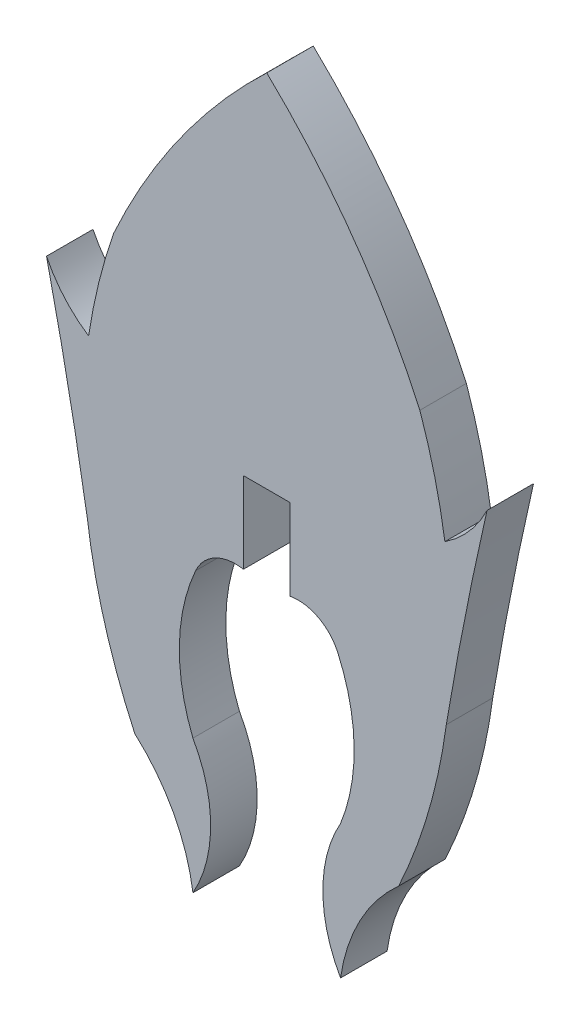
ISO-10303-21;
HEADER;
FILE_DESCRIPTION(('STEP AP214'),'2;1');
FILE_NAME('part.step','',(''),(''),'','','');
FILE_SCHEMA(('AUTOMOTIVE_DESIGN { 1 0 10303 214 1 1 1 1 }'));
ENDSEC;
DATA;
#1=APPLICATION_CONTEXT('core data for automotive mechanical design processes');
#2=APPLICATION_PROTOCOL_DEFINITION('international standard','automotive_design',2000,#1);
#3=PRODUCT_CONTEXT('',#1,'mechanical');
#4=PRODUCT('Part','Part','',(#3));
#5=PRODUCT_RELATED_PRODUCT_CATEGORY('part','',(#4));
#6=PRODUCT_DEFINITION_FORMATION('','',#4);
#7=PRODUCT_DEFINITION_CONTEXT('part definition',#1,'design');
#8=PRODUCT_DEFINITION('design','',#6,#7);
#9=PRODUCT_DEFINITION_SHAPE('','',#8);
#10=(LENGTH_UNIT() NAMED_UNIT(*) SI_UNIT(.MILLI.,.METRE.));
#11=(NAMED_UNIT(*) PLANE_ANGLE_UNIT() SI_UNIT($,.RADIAN.));
#12=(NAMED_UNIT(*) SI_UNIT($,.STERADIAN.) SOLID_ANGLE_UNIT());
#13=UNCERTAINTY_MEASURE_WITH_UNIT(LENGTH_MEASURE(1.E-05),#10,'distance_accuracy_value','');
#14=(GEOMETRIC_REPRESENTATION_CONTEXT(3) GLOBAL_UNCERTAINTY_ASSIGNED_CONTEXT((#13)) GLOBAL_UNIT_ASSIGNED_CONTEXT((#10,
#11,#12)) REPRESENTATION_CONTEXT('',''));
#15=CARTESIAN_POINT('',(0.,0.,0.));
#16=DIRECTION('',(0.,0.,1.));
#17=DIRECTION('',(1.,0.,0.));
#18=AXIS2_PLACEMENT_3D('',#15,#16,#17);
#19=CARTESIAN_POINT('',(-6.27252362891482,-9.76508493990558,1.524));
#20=DIRECTION('',(0.,0.,-1.));
#21=DIRECTION('',(-1.,0.,0.));
#22=AXIS2_PLACEMENT_3D('',#19,#20,#21);
#23=CYLINDRICAL_SURFACE('',#22,4.43516956083707);
#24=CARTESIAN_POINT('',(-6.27252362891482,-9.76508493990558,0.));
#25=DIRECTION('',(0.,0.,1.));
#26=DIRECTION('',(1.,0.,0.));
#27=AXIS2_PLACEMENT_3D('',#24,#25,#26);
#28=CIRCLE('',#27,4.43516956083707);
#29=CARTESIAN_POINT('',(-2.41824414537531,-7.57071516793412,0.));
#30=VERTEX_POINT('',#29);
#31=CARTESIAN_POINT('',(-2.41793526862089,-11.9589120994745,0.));
#32=VERTEX_POINT('',#31);
#33=EDGE_CURVE('E206',#30,#32,#28,.F.);
#34=ORIENTED_EDGE('',*,*,#33,.F.);
#35=DIRECTION('',(0.,0.,-1.));
#36=VECTOR('',#35,1.);
#37=CARTESIAN_POINT('',(-2.41824414537531,-7.57071516793412,1.524));
#38=LINE('',#37,#36);
#39=CARTESIAN_POINT('',(-2.41824414537531,-7.57071516793412,1.524));
#40=VERTEX_POINT('',#39);
#41=EDGE_CURVE('E11',#40,#30,#38,.T.);
#42=ORIENTED_EDGE('',*,*,#41,.F.);
#43=CARTESIAN_POINT('',(-6.27252362891482,-9.76508493990558,1.524));
#44=DIRECTION('',(0.,0.,1.));
#45=DIRECTION('',(1.,0.,0.));
#46=AXIS2_PLACEMENT_3D('',#43,#44,#45);
#47=CIRCLE('',#46,4.43516956083707);
#48=CARTESIAN_POINT('',(-2.41793526862089,-11.9589120994745,1.524));
#49=VERTEX_POINT('',#48);
#50=EDGE_CURVE('E258',#40,#49,#47,.F.);
#51=ORIENTED_EDGE('',*,*,#50,.T.);
#52=DIRECTION('',(0.,0.,-1.));
#53=VECTOR('',#52,1.);
#54=CARTESIAN_POINT('',(-2.41793526862089,-11.9589120994745,1.524));
#55=LINE('',#54,#53);
#56=EDGE_CURVE('E50',#49,#32,#55,.T.);
#57=ORIENTED_EDGE('',*,*,#56,.T.);
#58=EDGE_LOOP('',(#34,#42,#51,#57));
#59=FACE_BOUND('',#58,.T.);
#60=ADVANCED_FACE('F34',(#59),#23,.T.);
#61=CARTESIAN_POINT('',(3.26636391514258,-5.2767913050446,1.524));
#62=DIRECTION('',(0.,0.,-1.));
#63=DIRECTION('',(-1.,0.,0.));
#64=AXIS2_PLACEMENT_3D('',#61,#62,#63);
#65=CYLINDRICAL_SURFACE('',#64,6.12999636952902);
#66=CARTESIAN_POINT('',(3.26636391514258,-5.2767913050446,0.));
#67=DIRECTION('',(0.,0.,1.));
#68=DIRECTION('',(1.,0.,0.));
#69=AXIS2_PLACEMENT_3D('',#66,#67,#68);
#70=CIRCLE('',#69,6.12999636952902);
#71=CARTESIAN_POINT('',(-2.32866854028409,-2.77230187341165,0.));
#72=VERTEX_POINT('',#71);
#73=EDGE_CURVE('E208',#30,#72,#70,.F.);
#74=ORIENTED_EDGE('',*,*,#73,.T.);
#75=DIRECTION('',(0.,0.,-1.));
#76=VECTOR('',#75,1.);
#77=CARTESIAN_POINT('',(-2.32866854028409,-2.77230187341165,1.524));
#78=LINE('',#77,#76);
#79=CARTESIAN_POINT('',(-2.32866854028409,-2.77230187341165,1.524));
#80=VERTEX_POINT('',#79);
#81=EDGE_CURVE('E42',#80,#72,#78,.T.);
#82=ORIENTED_EDGE('',*,*,#81,.F.);
#83=CARTESIAN_POINT('',(3.26636391514258,-5.2767913050446,1.524));
#84=DIRECTION('',(0.,0.,1.));
#85=DIRECTION('',(1.,0.,0.));
#86=AXIS2_PLACEMENT_3D('',#83,#84,#85);
#87=CIRCLE('',#86,6.12999636952902);
#88=EDGE_CURVE('E322',#40,#80,#87,.F.);
#89=ORIENTED_EDGE('',*,*,#88,.F.);
#90=ORIENTED_EDGE('',*,*,#41,.T.);
#91=EDGE_LOOP('',(#74,#82,#89,#90));
#92=FACE_BOUND('',#91,.T.);
#93=ADVANCED_FACE('F368',(#92),#65,.F.);
#94=CARTESIAN_POINT('',(-1.02583500972069,-3.35442105462064,1.524));
#95=DIRECTION('',(0.,0.,-1.));
#96=DIRECTION('',(-1.,0.,0.));
#97=AXIS2_PLACEMENT_3D('',#94,#95,#96);
#98=CYLINDRICAL_SURFACE('',#97,1.42696809687243);
#99=CARTESIAN_POINT('',(-1.02583500972069,-3.35442105462064,0.));
#100=DIRECTION('',(0.,0.,1.));
#101=DIRECTION('',(1.,0.,0.));
#102=AXIS2_PLACEMENT_3D('',#99,#100,#101);
#103=CIRCLE('',#102,1.42696809687243);
#104=CARTESIAN_POINT('',(-0.763422706611532,-1.95178862498389,0.));
#105=VERTEX_POINT('',#104);
#106=EDGE_CURVE('E210',#72,#105,#103,.F.);
#107=ORIENTED_EDGE('',*,*,#106,.T.);
#108=DIRECTION('',(0.,0.,-1.));
#109=VECTOR('',#108,1.);
#110=CARTESIAN_POINT('',(-0.763422706611532,-1.95178862498389,1.524));
#111=LINE('',#110,#109);
#112=CARTESIAN_POINT('',(-0.763422706611532,-1.95178862498389,1.524));
#113=VERTEX_POINT('',#112);
#114=EDGE_CURVE('E296',#113,#105,#111,.T.);
#115=ORIENTED_EDGE('',*,*,#114,.F.);
#116=CARTESIAN_POINT('',(-1.02583500972069,-3.35442105462064,1.524));
#117=DIRECTION('',(0.,0.,1.));
#118=DIRECTION('',(1.,0.,0.));
#119=AXIS2_PLACEMENT_3D('',#116,#117,#118);
#120=CIRCLE('',#119,1.42696809687243);
#121=EDGE_CURVE('E304',#80,#113,#120,.F.);
#122=ORIENTED_EDGE('',*,*,#121,.F.);
#123=ORIENTED_EDGE('',*,*,#81,.T.);
#124=EDGE_LOOP('',(#107,#115,#122,#123));
#125=FACE_BOUND('',#124,.T.);
#126=ADVANCED_FACE('F302',(#125),#98,.F.);
#127=CARTESIAN_POINT('',(-0.761782717976915,0.000639877464380135,1.524));
#128=DIRECTION('',(0.999999647222261,-0.000839973424895943,0.));
#129=DIRECTION('',(0.000839973424895943,0.999999647222261,0.));
#130=AXIS2_PLACEMENT_3D('',#127,#128,#129);
#131=PLANE('',#130);
#132=DIRECTION('',(-0.000839973424895943,-0.999999647222261,0.));
#133=VECTOR('',#132,1.);
#134=CARTESIAN_POINT('',(-0.761782717976915,0.000639877464380135,0.));
#135=LINE('',#134,#133);
#136=CARTESIAN_POINT('',(-0.761189298872533,0.707113293703959,0.));
#137=VERTEX_POINT('',#136);
#138=EDGE_CURVE('E213',#137,#105,#135,.T.);
#139=ORIENTED_EDGE('',*,*,#138,.F.);
#140=DIRECTION('',(0.,0.,-1.));
#141=VECTOR('',#140,1.);
#142=CARTESIAN_POINT('',(-0.761189298872533,0.707113293703959,1.524));
#143=LINE('',#142,#141);
#144=CARTESIAN_POINT('',(-0.761189298872533,0.707113293703959,1.524));
#145=VERTEX_POINT('',#144);
#146=EDGE_CURVE('E294',#145,#137,#143,.T.);
#147=ORIENTED_EDGE('',*,*,#146,.F.);
#148=DIRECTION('',(-0.000839973424895943,-0.999999647222261,0.));
#149=VECTOR('',#148,1.);
#150=CARTESIAN_POINT('',(-0.761782717976915,0.000639877464380135,1.524));
#151=LINE('',#150,#149);
#152=EDGE_CURVE('E315',#145,#113,#151,.T.);
#153=ORIENTED_EDGE('',*,*,#152,.T.);
#154=ORIENTED_EDGE('',*,*,#114,.T.);
#155=EDGE_LOOP('',(#139,#147,#153,#154));
#156=FACE_BOUND('',#155,.T.);
#157=ADVANCED_FACE('F312',(#156),#131,.T.);
#158=CARTESIAN_POINT('',(0.,0.707113293703959,1.524));
#159=DIRECTION('',(0.,-1.,0.));
#160=DIRECTION('',(0.,0.,-1.));
#161=AXIS2_PLACEMENT_3D('',#158,#159,#160);
#162=PLANE('',#161);
#163=DIRECTION('',(-1.,0.,0.));
#164=VECTOR('',#163,1.);
#165=CARTESIAN_POINT('',(0.,0.707113293703959,0.));
#166=LINE('',#165,#164);
#167=CARTESIAN_POINT('',(0.762804564945485,0.707113293703959,0.));
#168=VERTEX_POINT('',#167);
#169=EDGE_CURVE('E216',#168,#137,#166,.T.);
#170=ORIENTED_EDGE('',*,*,#169,.F.);
#171=DIRECTION('',(0.,0.,-1.));
#172=VECTOR('',#171,1.);
#173=CARTESIAN_POINT('',(0.762804564945485,0.707113293703959,1.524));
#174=LINE('',#173,#172);
#175=CARTESIAN_POINT('',(0.762804564945485,0.707113293703959,1.524));
#176=VERTEX_POINT('',#175);
#177=EDGE_CURVE('E292',#176,#168,#174,.T.);
#178=ORIENTED_EDGE('',*,*,#177,.F.);
#179=DIRECTION('',(-1.,0.,0.));
#180=VECTOR('',#179,1.);
#181=CARTESIAN_POINT('',(0.,0.707113293703959,1.524));
#182=LINE('',#181,#180);
#183=EDGE_CURVE('E318',#176,#145,#182,.T.);
#184=ORIENTED_EDGE('',*,*,#183,.T.);
#185=ORIENTED_EDGE('',*,*,#146,.T.);
#186=EDGE_LOOP('',(#170,#178,#184,#185));
#187=FACE_BOUND('',#186,.T.);
#188=ADVANCED_FACE('F379',(#187),#162,.T.);
#189=CARTESIAN_POINT('',(0.762754788819708,-5.36888447037153E-05,1.524));
#190=DIRECTION('',(-0.999999997522759,7.03880793115617E-05,0.));
#191=DIRECTION('',(-7.03880793115618E-05,-0.999999997522759,0.));
#192=AXIS2_PLACEMENT_3D('',#189,#190,#191);
#193=PLANE('',#192);
#194=DIRECTION('',(7.03880793115617E-05,0.999999997522759,0.));
#195=VECTOR('',#194,1.);
#196=CARTESIAN_POINT('',(0.762754788819708,-5.36888447037153E-05,0.));
#197=LINE('',#196,#195);
#198=CARTESIAN_POINT('',(0.762617377917843,-1.95224364584012,0.));
#199=VERTEX_POINT('',#198);
#200=EDGE_CURVE('E219',#199,#168,#197,.T.);
#201=ORIENTED_EDGE('',*,*,#200,.F.);
#202=DIRECTION('',(0.,0.,-1.));
#203=VECTOR('',#202,1.);
#204=CARTESIAN_POINT('',(0.762617377917843,-1.95224364584012,1.524));
#205=LINE('',#204,#203);
#206=CARTESIAN_POINT('',(0.762617377917843,-1.95224364584012,1.524));
#207=VERTEX_POINT('',#206);
#208=EDGE_CURVE('E290',#207,#199,#205,.T.);
#209=ORIENTED_EDGE('',*,*,#208,.F.);
#210=DIRECTION('',(7.03880793115617E-05,0.999999997522759,0.));
#211=VECTOR('',#210,1.);
#212=CARTESIAN_POINT('',(0.762754788819708,-5.36888447037153E-05,1.524));
#213=LINE('',#212,#211);
#214=EDGE_CURVE('E320',#207,#176,#213,.T.);
#215=ORIENTED_EDGE('',*,*,#214,.T.);
#216=ORIENTED_EDGE('',*,*,#177,.T.);
#217=EDGE_LOOP('',(#201,#209,#215,#216));
#218=FACE_BOUND('',#217,.T.);
#219=ADVANCED_FACE('F382',(#218),#193,.T.);
#220=CARTESIAN_POINT('',(1.02745027579364,-3.35442105462064,1.524));
#221=DIRECTION('',(0.,0.,-1.));
#222=DIRECTION('',(-1.,0.,0.));
#223=AXIS2_PLACEMENT_3D('',#220,#221,#222);
#224=CYLINDRICAL_SURFACE('',#223,1.42696809687243);
#225=CARTESIAN_POINT('',(1.02745027579364,-3.35442105462064,0.));
#226=DIRECTION('',(0.,0.,1.));
#227=DIRECTION('',(1.,0.,0.));
#228=AXIS2_PLACEMENT_3D('',#225,#226,#227);
#229=CIRCLE('',#228,1.42696809687243);
#230=CARTESIAN_POINT('',(2.33028380635704,-2.77230187341165,0.));
#231=VERTEX_POINT('',#230);
#232=EDGE_CURVE('E222',#231,#199,#229,.T.);
#233=ORIENTED_EDGE('',*,*,#232,.F.);
#234=DIRECTION('',(0.,0.,-1.));
#235=VECTOR('',#234,1.);
#236=CARTESIAN_POINT('',(2.33028380635704,-2.77230187341165,1.524));
#237=LINE('',#236,#235);
#238=CARTESIAN_POINT('',(2.33028380635704,-2.77230187341165,1.524));
#239=VERTEX_POINT('',#238);
#240=EDGE_CURVE('E288',#239,#231,#237,.T.);
#241=ORIENTED_EDGE('',*,*,#240,.F.);
#242=CARTESIAN_POINT('',(1.02745027579364,-3.35442105462064,1.524));
#243=DIRECTION('',(0.,0.,1.));
#244=DIRECTION('',(1.,0.,0.));
#245=AXIS2_PLACEMENT_3D('',#242,#243,#244);
#246=CIRCLE('',#245,1.42696809687243);
#247=EDGE_CURVE('E328',#239,#207,#246,.T.);
#248=ORIENTED_EDGE('',*,*,#247,.T.);
#249=ORIENTED_EDGE('',*,*,#208,.T.);
#250=EDGE_LOOP('',(#233,#241,#248,#249));
#251=FACE_BOUND('',#250,.T.);
#252=ADVANCED_FACE('F386',(#251),#224,.F.);
#253=CARTESIAN_POINT('',(-3.26474864906963,-5.2767913050446,1.524));
#254=DIRECTION('',(0.,0.,-1.));
#255=DIRECTION('',(-1.,0.,0.));
#256=AXIS2_PLACEMENT_3D('',#253,#254,#255);
#257=CYLINDRICAL_SURFACE('',#256,6.12999636952902);
#258=CARTESIAN_POINT('',(-3.26474864906963,-5.2767913050446,0.));
#259=DIRECTION('',(0.,0.,1.));
#260=DIRECTION('',(1.,0.,0.));
#261=AXIS2_PLACEMENT_3D('',#258,#259,#260);
#262=CIRCLE('',#261,6.12999636952902);
#263=CARTESIAN_POINT('',(2.41985941144826,-7.57071516793412,0.));
#264=VERTEX_POINT('',#263);
#265=EDGE_CURVE('E225',#264,#231,#262,.T.);
#266=ORIENTED_EDGE('',*,*,#265,.F.);
#267=DIRECTION('',(0.,0.,-1.));
#268=VECTOR('',#267,1.);
#269=CARTESIAN_POINT('',(2.41985941144826,-7.57071516793412,1.524));
#270=LINE('',#269,#268);
#271=CARTESIAN_POINT('',(2.41985941144826,-7.57071516793412,1.524));
#272=VERTEX_POINT('',#271);
#273=EDGE_CURVE('E286',#272,#264,#270,.T.);
#274=ORIENTED_EDGE('',*,*,#273,.F.);
#275=CARTESIAN_POINT('',(-3.26474864906963,-5.2767913050446,1.524));
#276=DIRECTION('',(0.,0.,1.));
#277=DIRECTION('',(1.,0.,0.));
#278=AXIS2_PLACEMENT_3D('',#275,#276,#277);
#279=CIRCLE('',#278,6.12999636952902);
#280=EDGE_CURVE('E331',#272,#239,#279,.T.);
#281=ORIENTED_EDGE('',*,*,#280,.T.);
#282=ORIENTED_EDGE('',*,*,#240,.T.);
#283=EDGE_LOOP('',(#266,#274,#281,#282));
#284=FACE_BOUND('',#283,.T.);
#285=ADVANCED_FACE('F390',(#284),#257,.F.);
#286=CARTESIAN_POINT('',(6.27413889498777,-9.76508493990558,1.524));
#287=DIRECTION('',(0.,0.,-1.));
#288=DIRECTION('',(-1.,0.,0.));
#289=AXIS2_PLACEMENT_3D('',#286,#287,#288);
#290=CYLINDRICAL_SURFACE('',#289,4.43516956083707);
#291=CARTESIAN_POINT('',(6.27413889498777,-9.76508493990558,0.));
#292=DIRECTION('',(0.,0.,1.));
#293=DIRECTION('',(1.,0.,0.));
#294=AXIS2_PLACEMENT_3D('',#291,#292,#293);
#295=CIRCLE('',#294,4.43516956083707);
#296=CARTESIAN_POINT('',(2.41955053469384,-11.9589120994745,0.));
#297=VERTEX_POINT('',#296);
#298=EDGE_CURVE('E228',#264,#297,#295,.T.);
#299=ORIENTED_EDGE('',*,*,#298,.T.);
#300=DIRECTION('',(0.,0.,-1.));
#301=VECTOR('',#300,1.);
#302=CARTESIAN_POINT('',(2.41955053469384,-11.9589120994745,1.524));
#303=LINE('',#302,#301);
#304=CARTESIAN_POINT('',(2.41955053469384,-11.9589120994745,1.524));
#305=VERTEX_POINT('',#304);
#306=EDGE_CURVE('E283',#305,#297,#303,.T.);
#307=ORIENTED_EDGE('',*,*,#306,.F.);
#308=CARTESIAN_POINT('',(6.27413889498777,-9.76508493990558,1.524));
#309=DIRECTION('',(0.,0.,1.));
#310=DIRECTION('',(1.,0.,0.));
#311=AXIS2_PLACEMENT_3D('',#308,#309,#310);
#312=CIRCLE('',#311,4.43516956083707);
#313=EDGE_CURVE('E334',#272,#305,#312,.T.);
#314=ORIENTED_EDGE('',*,*,#313,.F.);
#315=ORIENTED_EDGE('',*,*,#273,.T.);
#316=EDGE_LOOP('',(#299,#307,#314,#315));
#317=FACE_BOUND('',#316,.T.);
#318=ADVANCED_FACE('F394',(#317),#290,.T.);
#319=CARTESIAN_POINT('',(8.24179872750828,-12.7815062430866,1.524));
#320=DIRECTION('',(0.,0.,-1.));
#321=DIRECTION('',(-1.,0.,0.));
#322=AXIS2_PLACEMENT_3D('',#319,#320,#321);
#323=CYLINDRICAL_SURFACE('',#322,5.88007101520346);
#324=CARTESIAN_POINT('',(8.24179872750828,-12.7815062430866,0.));
#325=DIRECTION('',(0.,0.,1.));
#326=DIRECTION('',(1.,0.,0.));
#327=AXIS2_PLACEMENT_3D('',#324,#325,#326);
#328=CIRCLE('',#327,5.88007101520346);
#329=CARTESIAN_POINT('',(4.32426614594106,-8.39651210213324,0.));
#330=VERTEX_POINT('',#329);
#331=EDGE_CURVE('E230',#297,#330,#328,.F.);
#332=ORIENTED_EDGE('',*,*,#331,.T.);
#333=DIRECTION('',(0.,0.,-1.));
#334=VECTOR('',#333,1.);
#335=CARTESIAN_POINT('',(4.32426614594106,-8.39651210213324,1.524));
#336=LINE('',#335,#334);
#337=CARTESIAN_POINT('',(4.32426614594106,-8.39651210213324,1.524));
#338=VERTEX_POINT('',#337);
#339=EDGE_CURVE('E280',#338,#330,#336,.T.);
#340=ORIENTED_EDGE('',*,*,#339,.F.);
#341=CARTESIAN_POINT('',(8.24179872750828,-12.7815062430866,1.524));
#342=DIRECTION('',(0.,0.,1.));
#343=DIRECTION('',(1.,0.,0.));
#344=AXIS2_PLACEMENT_3D('',#341,#342,#343);
#345=CIRCLE('',#344,5.88007101520346);
#346=EDGE_CURVE('E336',#305,#338,#345,.F.);
#347=ORIENTED_EDGE('',*,*,#346,.F.);
#348=ORIENTED_EDGE('',*,*,#306,.T.);
#349=EDGE_LOOP('',(#332,#340,#347,#348));
#350=FACE_BOUND('',#349,.T.);
#351=ADVANCED_FACE('F398',(#350),#323,.F.);
#352=CARTESIAN_POINT('',(-12.4305008731216,-0.61373519556035,1.524));
#353=DIRECTION('',(0.,0.,-1.));
#354=DIRECTION('',(-1.,0.,0.));
#355=AXIS2_PLACEMENT_3D('',#352,#353,#354);
#356=CYLINDRICAL_SURFACE('',#355,18.4741396075853);
#357=CARTESIAN_POINT('',(-12.4305008731216,-0.61373519556035,0.));
#358=DIRECTION('',(0.,0.,1.));
#359=DIRECTION('',(1.,0.,0.));
#360=AXIS2_PLACEMENT_3D('',#357,#358,#359);
#361=CIRCLE('',#360,18.4741396075853);
#362=CARTESIAN_POINT('',(5.8838621243449,-3.03818198556912,0.));
#363=VERTEX_POINT('',#362);
#364=EDGE_CURVE('E232',#330,#363,#361,.T.);
#365=ORIENTED_EDGE('',*,*,#364,.T.);
#366=DIRECTION('',(0.,0.,-1.));
#367=VECTOR('',#366,1.);
#368=CARTESIAN_POINT('',(5.8838621243449,-3.03818198556912,1.524));
#369=LINE('',#368,#367);
#370=CARTESIAN_POINT('',(5.8838621243449,-3.03818198556912,1.524));
#371=VERTEX_POINT('',#370);
#372=EDGE_CURVE('E277',#371,#363,#369,.T.);
#373=ORIENTED_EDGE('',*,*,#372,.F.);
#374=CARTESIAN_POINT('',(-12.4305008731216,-0.61373519556035,1.524));
#375=DIRECTION('',(0.,0.,1.));
#376=DIRECTION('',(1.,0.,0.));
#377=AXIS2_PLACEMENT_3D('',#374,#375,#376);
#378=CIRCLE('',#377,18.4741396075853);
#379=EDGE_CURVE('E338',#338,#371,#378,.T.);
#380=ORIENTED_EDGE('',*,*,#379,.F.);
#381=ORIENTED_EDGE('',*,*,#339,.T.);
#382=EDGE_LOOP('',(#365,#373,#380,#381));
#383=FACE_BOUND('',#382,.T.);
#384=ADVANCED_FACE('F402',(#383),#356,.T.);
#385=CARTESIAN_POINT('',(120.994155450349,-22.2938081637475,1.524));
#386=DIRECTION('',(0.,0.,-1.));
#387=DIRECTION('',(-1.,0.,0.));
#388=AXIS2_PLACEMENT_3D('',#385,#386,#387);
#389=CYLINDRICAL_SURFACE('',#388,116.709720114104);
#390=CARTESIAN_POINT('',(120.994155450349,-22.2938081637475,0.));
#391=DIRECTION('',(0.,0.,1.));
#392=DIRECTION('',(1.,0.,0.));
#393=AXIS2_PLACEMENT_3D('',#390,#391,#392);
#394=CIRCLE('',#393,116.709720114104);
#395=CARTESIAN_POINT('',(7.21786845124299,3.708408776535,0.));
#396=VERTEX_POINT('',#395);
#397=EDGE_CURVE('E234',#363,#396,#394,.F.);
#398=ORIENTED_EDGE('',*,*,#397,.T.);
#399=DIRECTION('',(0.,0.,-1.));
#400=VECTOR('',#399,1.);
#401=CARTESIAN_POINT('',(7.21786845124299,3.708408776535,1.524));
#402=LINE('',#401,#400);
#403=CARTESIAN_POINT('',(7.21786845124299,3.708408776535,1.524));
#404=VERTEX_POINT('',#403);
#405=EDGE_CURVE('E274',#404,#396,#402,.T.);
#406=ORIENTED_EDGE('',*,*,#405,.F.);
#407=CARTESIAN_POINT('',(120.994155450349,-22.2938081637475,1.524));
#408=DIRECTION('',(0.,0.,1.));
#409=DIRECTION('',(1.,0.,0.));
#410=AXIS2_PLACEMENT_3D('',#407,#408,#409);
#411=CIRCLE('',#410,116.709720114104);
#412=EDGE_CURVE('E340',#371,#404,#411,.F.);
#413=ORIENTED_EDGE('',*,*,#412,.F.);
#414=ORIENTED_EDGE('',*,*,#372,.T.);
#415=EDGE_LOOP('',(#398,#406,#413,#414));
#416=FACE_BOUND('',#415,.T.);
#417=ADVANCED_FACE('F406',(#416),#389,.F.);
#418=CARTESIAN_POINT('',(3.6666737633141,5.42919922843956,1.524));
#419=DIRECTION('',(0.,0.,-1.));
#420=DIRECTION('',(-1.,0.,0.));
#421=AXIS2_PLACEMENT_3D('',#418,#419,#420);
#422=CYLINDRICAL_SURFACE('',#421,3.94615046481255);
#423=CARTESIAN_POINT('',(3.6666737633141,5.42919922843956,0.));
#424=DIRECTION('',(0.,0.,1.));
#425=DIRECTION('',(1.,0.,0.));
#426=AXIS2_PLACEMENT_3D('',#423,#424,#425);
#427=CIRCLE('',#426,3.94615046481255);
#428=CARTESIAN_POINT('',(5.83812245062997,2.13421605863513,0.));
#429=VERTEX_POINT('',#428);
#430=EDGE_CURVE('E236',#396,#429,#427,.F.);
#431=ORIENTED_EDGE('',*,*,#430,.T.);
#432=DIRECTION('',(0.,0.,-1.));
#433=VECTOR('',#432,1.);
#434=CARTESIAN_POINT('',(5.83812245062997,2.13421605863513,1.524));
#435=LINE('',#434,#433);
#436=CARTESIAN_POINT('',(5.83812245062997,2.13421605863513,1.524));
#437=VERTEX_POINT('',#436);
#438=EDGE_CURVE('E271',#437,#429,#435,.T.);
#439=ORIENTED_EDGE('',*,*,#438,.F.);
#440=CARTESIAN_POINT('',(3.6666737633141,5.42919922843956,1.524));
#441=DIRECTION('',(0.,0.,1.));
#442=DIRECTION('',(1.,0.,0.));
#443=AXIS2_PLACEMENT_3D('',#440,#441,#442);
#444=CIRCLE('',#443,3.94615046481255);
#445=EDGE_CURVE('E342',#404,#437,#444,.F.);
#446=ORIENTED_EDGE('',*,*,#445,.F.);
#447=ORIENTED_EDGE('',*,*,#405,.T.);
#448=EDGE_LOOP('',(#431,#439,#446,#447));
#449=FACE_BOUND('',#448,.T.);
#450=ADVANCED_FACE('F410',(#449),#422,.F.);
#451=CARTESIAN_POINT('',(-12.4305008731216,-0.61373519556035,1.524));
#452=DIRECTION('',(0.,0.,-1.));
#453=DIRECTION('',(-1.,0.,0.));
#454=AXIS2_PLACEMENT_3D('',#451,#452,#453);
#455=CYLINDRICAL_SURFACE('',#454,18.4741396075853);
#456=CARTESIAN_POINT('',(-12.4305008731216,-0.61373519556035,0.));
#457=DIRECTION('',(0.,0.,1.));
#458=DIRECTION('',(1.,0.,0.));
#459=AXIS2_PLACEMENT_3D('',#456,#457,#458);
#460=CIRCLE('',#459,18.4741396075853);
#461=CARTESIAN_POINT('',(5.01871628301209,5.45410254770898,0.));
#462=VERTEX_POINT('',#461);
#463=EDGE_CURVE('E238',#429,#462,#460,.T.);
#464=ORIENTED_EDGE('',*,*,#463,.T.);
#465=DIRECTION('',(0.,0.,-1.));
#466=VECTOR('',#465,1.);
#467=CARTESIAN_POINT('',(5.01871628301209,5.45410254770898,1.524));
#468=LINE('',#467,#466);
#469=CARTESIAN_POINT('',(5.01871628301209,5.45410254770898,1.524));
#470=VERTEX_POINT('',#469);
#471=EDGE_CURVE('E268',#470,#462,#468,.T.);
#472=ORIENTED_EDGE('',*,*,#471,.F.);
#473=CARTESIAN_POINT('',(-12.4305008731216,-0.61373519556035,1.524));
#474=DIRECTION('',(0.,0.,1.));
#475=DIRECTION('',(1.,0.,0.));
#476=AXIS2_PLACEMENT_3D('',#473,#474,#475);
#477=CIRCLE('',#476,18.4741396075853);
#478=EDGE_CURVE('E344',#437,#470,#477,.T.);
#479=ORIENTED_EDGE('',*,*,#478,.F.);
#480=ORIENTED_EDGE('',*,*,#438,.T.);
#481=EDGE_LOOP('',(#464,#472,#479,#480));
#482=FACE_BOUND('',#481,.T.);
#483=ADVANCED_FACE('F414',(#482),#455,.T.);
#484=CARTESIAN_POINT('',(-15.5922210539829,-3.87017137836756,1.524));
#485=DIRECTION('',(0.,0.,-1.));
#486=DIRECTION('',(-1.,0.,0.));
#487=AXIS2_PLACEMENT_3D('',#484,#485,#486);
#488=CYLINDRICAL_SURFACE('',#487,22.6219544283434);
#489=CARTESIAN_POINT('',(-15.5922210539829,-3.87017137836756,0.));
#490=DIRECTION('',(0.,0.,1.));
#491=DIRECTION('',(1.,0.,0.));
#492=AXIS2_PLACEMENT_3D('',#489,#490,#491);
#493=CIRCLE('',#492,22.6219544283434);
#494=CARTESIAN_POINT('',(0.000807633036474173,12.5191629132941,0.));
#495=VERTEX_POINT('',#494);
#496=EDGE_CURVE('E240',#462,#495,#493,.T.);
#497=ORIENTED_EDGE('',*,*,#496,.T.);
#498=DIRECTION('',(0.,0.,-1.));
#499=VECTOR('',#498,1.);
#500=CARTESIAN_POINT('',(0.000807633036474173,12.5191629132941,1.524));
#501=LINE('',#500,#499);
#502=CARTESIAN_POINT('',(0.000807633036474173,12.5191629132941,1.524));
#503=VERTEX_POINT('',#502);
#504=EDGE_CURVE('E266',#503,#495,#501,.T.);
#505=ORIENTED_EDGE('',*,*,#504,.F.);
#506=CARTESIAN_POINT('',(-15.5922210539829,-3.87017137836756,1.524));
#507=DIRECTION('',(0.,0.,1.));
#508=DIRECTION('',(1.,0.,0.));
#509=AXIS2_PLACEMENT_3D('',#506,#507,#508);
#510=CIRCLE('',#509,22.6219544283434);
#511=EDGE_CURVE('E346',#470,#503,#510,.T.);
#512=ORIENTED_EDGE('',*,*,#511,.F.);
#513=ORIENTED_EDGE('',*,*,#471,.T.);
#514=EDGE_LOOP('',(#497,#505,#512,#513));
#515=FACE_BOUND('',#514,.T.);
#516=ADVANCED_FACE('F418',(#515),#488,.T.);
#517=CARTESIAN_POINT('',(15.5938363200559,-3.87017137836756,1.524));
#518=DIRECTION('',(0.,0.,-1.));
#519=DIRECTION('',(-1.,0.,0.));
#520=AXIS2_PLACEMENT_3D('',#517,#518,#519);
#521=CYLINDRICAL_SURFACE('',#520,22.6219544283434);
#522=CARTESIAN_POINT('',(15.5938363200559,-3.87017137836756,0.));
#523=DIRECTION('',(0.,0.,1.));
#524=DIRECTION('',(1.,0.,0.));
#525=AXIS2_PLACEMENT_3D('',#522,#523,#524);
#526=CIRCLE('',#525,22.6219544283434);
#527=CARTESIAN_POINT('',(-5.01710101693914,5.45410254770898,0.));
#528=VERTEX_POINT('',#527);
#529=EDGE_CURVE('E243',#528,#495,#526,.F.);
#530=ORIENTED_EDGE('',*,*,#529,.F.);
#531=DIRECTION('',(0.,0.,-1.));
#532=VECTOR('',#531,1.);
#533=CARTESIAN_POINT('',(-5.01710101693914,5.45410254770898,1.524));
#534=LINE('',#533,#532);
#535=CARTESIAN_POINT('',(-5.01710101693914,5.45410254770898,1.524));
#536=VERTEX_POINT('',#535);
#537=EDGE_CURVE('E264',#536,#528,#534,.T.);
#538=ORIENTED_EDGE('',*,*,#537,.F.);
#539=CARTESIAN_POINT('',(15.5938363200559,-3.87017137836756,1.524));
#540=DIRECTION('',(0.,0.,1.));
#541=DIRECTION('',(1.,0.,0.));
#542=AXIS2_PLACEMENT_3D('',#539,#540,#541);
#543=CIRCLE('',#542,22.6219544283434);
#544=EDGE_CURVE('E348',#536,#503,#543,.F.);
#545=ORIENTED_EDGE('',*,*,#544,.T.);
#546=ORIENTED_EDGE('',*,*,#504,.T.);
#547=EDGE_LOOP('',(#530,#538,#545,#546));
#548=FACE_BOUND('',#547,.T.);
#549=ADVANCED_FACE('F422',(#548),#521,.T.);
#550=CARTESIAN_POINT('',(12.4321161391945,-0.61373519556035,1.524));
#551=DIRECTION('',(0.,0.,-1.));
#552=DIRECTION('',(-1.,0.,0.));
#553=AXIS2_PLACEMENT_3D('',#550,#551,#552);
#554=CYLINDRICAL_SURFACE('',#553,18.4741396075853);
#555=CARTESIAN_POINT('',(12.4321161391945,-0.61373519556035,0.));
#556=DIRECTION('',(0.,0.,1.));
#557=DIRECTION('',(1.,0.,0.));
#558=AXIS2_PLACEMENT_3D('',#555,#556,#557);
#559=CIRCLE('',#558,18.4741396075853);
#560=CARTESIAN_POINT('',(-5.83650718455702,2.13421605863513,0.));
#561=VERTEX_POINT('',#560);
#562=EDGE_CURVE('E246',#561,#528,#559,.F.);
#563=ORIENTED_EDGE('',*,*,#562,.F.);
#564=DIRECTION('',(0.,0.,-1.));
#565=VECTOR('',#564,1.);
#566=CARTESIAN_POINT('',(-5.83650718455702,2.13421605863513,1.524));
#567=LINE('',#566,#565);
#568=CARTESIAN_POINT('',(-5.83650718455702,2.13421605863513,1.524));
#569=VERTEX_POINT('',#568);
#570=EDGE_CURVE('E262',#569,#561,#567,.T.);
#571=ORIENTED_EDGE('',*,*,#570,.F.);
#572=CARTESIAN_POINT('',(12.4321161391945,-0.61373519556035,1.524));
#573=DIRECTION('',(0.,0.,1.));
#574=DIRECTION('',(1.,0.,0.));
#575=AXIS2_PLACEMENT_3D('',#572,#573,#574);
#576=CIRCLE('',#575,18.4741396075853);
#577=EDGE_CURVE('E351',#569,#536,#576,.F.);
#578=ORIENTED_EDGE('',*,*,#577,.T.);
#579=ORIENTED_EDGE('',*,*,#537,.T.);
#580=EDGE_LOOP('',(#563,#571,#578,#579));
#581=FACE_BOUND('',#580,.T.);
#582=ADVANCED_FACE('F426',(#581),#554,.T.);
#583=CARTESIAN_POINT('',(-3.66505849724115,5.42919922843956,1.524));
#584=DIRECTION('',(0.,0.,-1.));
#585=DIRECTION('',(-1.,0.,0.));
#586=AXIS2_PLACEMENT_3D('',#583,#584,#585);
#587=CYLINDRICAL_SURFACE('',#586,3.94615046481255);
#588=CARTESIAN_POINT('',(-3.66505849724115,5.42919922843956,0.));
#589=DIRECTION('',(0.,0.,1.));
#590=DIRECTION('',(1.,0.,0.));
#591=AXIS2_PLACEMENT_3D('',#588,#589,#590);
#592=CIRCLE('',#591,3.94615046481255);
#593=CARTESIAN_POINT('',(-7.21625318517004,3.708408776535,0.));
#594=VERTEX_POINT('',#593);
#595=EDGE_CURVE('E249',#594,#561,#592,.T.);
#596=ORIENTED_EDGE('',*,*,#595,.F.);
#597=DIRECTION('',(0.,0.,-1.));
#598=VECTOR('',#597,1.);
#599=CARTESIAN_POINT('',(-7.21625318517004,3.708408776535,1.524));
#600=LINE('',#599,#598);
#601=CARTESIAN_POINT('',(-7.21625318517004,3.708408776535,1.524));
#602=VERTEX_POINT('',#601);
#603=EDGE_CURVE('E187',#602,#594,#600,.T.);
#604=ORIENTED_EDGE('',*,*,#603,.F.);
#605=CARTESIAN_POINT('',(-3.66505849724115,5.42919922843956,1.524));
#606=DIRECTION('',(0.,0.,1.));
#607=DIRECTION('',(1.,0.,0.));
#608=AXIS2_PLACEMENT_3D('',#605,#606,#607);
#609=CIRCLE('',#608,3.94615046481255);
#610=EDGE_CURVE('E198',#602,#569,#609,.T.);
#611=ORIENTED_EDGE('',*,*,#610,.T.);
#612=ORIENTED_EDGE('',*,*,#570,.T.);
#613=EDGE_LOOP('',(#596,#604,#611,#612));
#614=FACE_BOUND('',#613,.T.);
#615=ADVANCED_FACE('F355',(#614),#587,.F.);
#616=CARTESIAN_POINT('',(-120.992540184276,-22.2938081637475,1.524));
#617=DIRECTION('',(0.,0.,-1.));
#618=DIRECTION('',(-1.,0.,0.));
#619=AXIS2_PLACEMENT_3D('',#616,#617,#618);
#620=CYLINDRICAL_SURFACE('',#619,116.709720114104);
#621=CARTESIAN_POINT('',(-120.992540184276,-22.2938081637475,0.));
#622=DIRECTION('',(0.,0.,1.));
#623=DIRECTION('',(1.,0.,0.));
#624=AXIS2_PLACEMENT_3D('',#621,#622,#623);
#625=CIRCLE('',#624,116.709720114104);
#626=CARTESIAN_POINT('',(-5.88224685827193,-3.03818198556911,0.));
#627=VERTEX_POINT('',#626);
#628=EDGE_CURVE('E183',#627,#594,#625,.T.);
#629=ORIENTED_EDGE('',*,*,#628,.F.);
#630=DIRECTION('',(0.,0.,-1.));
#631=VECTOR('',#630,1.);
#632=CARTESIAN_POINT('',(-5.88224685827193,-3.03818198556911,1.524));
#633=LINE('',#632,#631);
#634=CARTESIAN_POINT('',(-5.88224685827193,-3.03818198556911,1.524));
#635=VERTEX_POINT('',#634);
#636=EDGE_CURVE('E178',#635,#627,#633,.T.);
#637=ORIENTED_EDGE('',*,*,#636,.F.);
#638=CARTESIAN_POINT('',(-120.992540184276,-22.2938081637475,1.524));
#639=DIRECTION('',(0.,0.,1.));
#640=DIRECTION('',(1.,0.,0.));
#641=AXIS2_PLACEMENT_3D('',#638,#639,#640);
#642=CIRCLE('',#641,116.709720114104);
#643=EDGE_CURVE('E181',#635,#602,#642,.T.);
#644=ORIENTED_EDGE('',*,*,#643,.T.);
#645=ORIENTED_EDGE('',*,*,#603,.T.);
#646=EDGE_LOOP('',(#629,#637,#644,#645));
#647=FACE_BOUND('',#646,.T.);
#648=ADVANCED_FACE('F180',(#647),#620,.F.);
#649=CARTESIAN_POINT('',(12.4321161391945,-0.61373519556035,1.524));
#650=DIRECTION('',(0.,0.,-1.));
#651=DIRECTION('',(-1.,0.,0.));
#652=AXIS2_PLACEMENT_3D('',#649,#650,#651);
#653=CYLINDRICAL_SURFACE('',#652,18.4741396075853);
#654=CARTESIAN_POINT('',(12.4321161391945,-0.61373519556035,0.));
#655=DIRECTION('',(0.,0.,1.));
#656=DIRECTION('',(1.,0.,0.));
#657=AXIS2_PLACEMENT_3D('',#654,#655,#656);
#658=CIRCLE('',#657,18.4741396075853);
#659=CARTESIAN_POINT('',(-4.32265087986809,-8.39651210213325,0.));
#660=VERTEX_POINT('',#659);
#661=EDGE_CURVE('E253',#660,#627,#658,.F.);
#662=ORIENTED_EDGE('',*,*,#661,.F.);
#663=DIRECTION('',(0.,0.,-1.));
#664=VECTOR('',#663,1.);
#665=CARTESIAN_POINT('',(-4.32265087986809,-8.39651210213325,1.524));
#666=LINE('',#665,#664);
#667=CARTESIAN_POINT('',(-4.32265087986809,-8.39651210213325,1.524));
#668=VERTEX_POINT('',#667);
#669=EDGE_CURVE('E114',#668,#660,#666,.T.);
#670=ORIENTED_EDGE('',*,*,#669,.F.);
#671=CARTESIAN_POINT('',(12.4321161391945,-0.61373519556035,1.524));
#672=DIRECTION('',(0.,0.,1.));
#673=DIRECTION('',(1.,0.,0.));
#674=AXIS2_PLACEMENT_3D('',#671,#672,#673);
#675=CIRCLE('',#674,18.4741396075853);
#676=EDGE_CURVE('E195',#668,#635,#675,.F.);
#677=ORIENTED_EDGE('',*,*,#676,.T.);
#678=ORIENTED_EDGE('',*,*,#636,.T.);
#679=EDGE_LOOP('',(#662,#670,#677,#678));
#680=FACE_BOUND('',#679,.T.);
#681=ADVANCED_FACE('F200',(#680),#653,.T.);
#682=CARTESIAN_POINT('',(-8.24018346143533,-12.7815062430866,1.524));
#683=DIRECTION('',(0.,0.,-1.));
#684=DIRECTION('',(-1.,0.,0.));
#685=AXIS2_PLACEMENT_3D('',#682,#683,#684);
#686=CYLINDRICAL_SURFACE('',#685,5.88007101520346);
#687=CARTESIAN_POINT('',(-8.24018346143533,-12.7815062430866,0.));
#688=DIRECTION('',(0.,0.,1.));
#689=DIRECTION('',(1.,0.,0.));
#690=AXIS2_PLACEMENT_3D('',#687,#688,#689);
#691=CIRCLE('',#690,5.88007101520346);
#692=EDGE_CURVE('E255',#32,#660,#691,.T.);
#693=ORIENTED_EDGE('',*,*,#692,.F.);
#694=ORIENTED_EDGE('',*,*,#56,.F.);
#695=CARTESIAN_POINT('',(-8.24018346143533,-12.7815062430866,1.524));
#696=DIRECTION('',(0.,0.,1.));
#697=DIRECTION('',(1.,0.,0.));
#698=AXIS2_PLACEMENT_3D('',#695,#696,#697);
#699=CIRCLE('',#698,5.88007101520346);
#700=EDGE_CURVE('E201',#49,#668,#699,.T.);
#701=ORIENTED_EDGE('',*,*,#700,.T.);
#702=ORIENTED_EDGE('',*,*,#669,.T.);
#703=EDGE_LOOP('',(#693,#694,#701,#702));
#704=FACE_BOUND('',#703,.T.);
#705=ADVANCED_FACE('F357',(#704),#686,.F.);
#706=CARTESIAN_POINT('',(0.,0.,1.524));
#707=DIRECTION('',(0.,0.,1.));
#708=DIRECTION('',(1.,0.,0.));
#709=AXIS2_PLACEMENT_3D('',#706,#707,#708);
#710=PLANE('',#709);
#711=ORIENTED_EDGE('',*,*,#50,.F.);
#712=ORIENTED_EDGE('',*,*,#88,.T.);
#713=ORIENTED_EDGE('',*,*,#121,.T.);
#714=ORIENTED_EDGE('',*,*,#152,.F.);
#715=ORIENTED_EDGE('',*,*,#183,.F.);
#716=ORIENTED_EDGE('',*,*,#214,.F.);
#717=ORIENTED_EDGE('',*,*,#247,.F.);
#718=ORIENTED_EDGE('',*,*,#280,.F.);
#719=ORIENTED_EDGE('',*,*,#313,.T.);
#720=ORIENTED_EDGE('',*,*,#346,.T.);
#721=ORIENTED_EDGE('',*,*,#379,.T.);
#722=ORIENTED_EDGE('',*,*,#412,.T.);
#723=ORIENTED_EDGE('',*,*,#445,.T.);
#724=ORIENTED_EDGE('',*,*,#478,.T.);
#725=ORIENTED_EDGE('',*,*,#511,.T.);
#726=ORIENTED_EDGE('',*,*,#544,.F.);
#727=ORIENTED_EDGE('',*,*,#577,.F.);
#728=ORIENTED_EDGE('',*,*,#610,.F.);
#729=ORIENTED_EDGE('',*,*,#643,.F.);
#730=ORIENTED_EDGE('',*,*,#676,.F.);
#731=ORIENTED_EDGE('',*,*,#700,.F.);
#732=EDGE_LOOP('',(#711,#712,#713,#714,#715,#716,#717,#718,#719,#720,#721,#722,#723,#724,#725,
#726,#727,#728,#729,#730,#731));
#733=FACE_BOUND('',#732,.T.);
#734=ADVANCED_FACE('F193',(#733),#710,.T.);
#735=CARTESIAN_POINT('',(0.,0.,0.));
#736=DIRECTION('',(0.,0.,1.));
#737=DIRECTION('',(1.,0.,0.));
#738=AXIS2_PLACEMENT_3D('',#735,#736,#737);
#739=PLANE('',#738);
#740=ORIENTED_EDGE('',*,*,#33,.T.);
#741=ORIENTED_EDGE('',*,*,#692,.T.);
#742=ORIENTED_EDGE('',*,*,#661,.T.);
#743=ORIENTED_EDGE('',*,*,#628,.T.);
#744=ORIENTED_EDGE('',*,*,#595,.T.);
#745=ORIENTED_EDGE('',*,*,#562,.T.);
#746=ORIENTED_EDGE('',*,*,#529,.T.);
#747=ORIENTED_EDGE('',*,*,#496,.F.);
#748=ORIENTED_EDGE('',*,*,#463,.F.);
#749=ORIENTED_EDGE('',*,*,#430,.F.);
#750=ORIENTED_EDGE('',*,*,#397,.F.);
#751=ORIENTED_EDGE('',*,*,#364,.F.);
#752=ORIENTED_EDGE('',*,*,#331,.F.);
#753=ORIENTED_EDGE('',*,*,#298,.F.);
#754=ORIENTED_EDGE('',*,*,#265,.T.);
#755=ORIENTED_EDGE('',*,*,#232,.T.);
#756=ORIENTED_EDGE('',*,*,#200,.T.);
#757=ORIENTED_EDGE('',*,*,#169,.T.);
#758=ORIENTED_EDGE('',*,*,#138,.T.);
#759=ORIENTED_EDGE('',*,*,#106,.F.);
#760=ORIENTED_EDGE('',*,*,#73,.F.);
#761=EDGE_LOOP('',(#740,#741,#742,#743,#744,#745,#746,#747,#748,#749,#750,#751,#752,#753,#754,
#755,#756,#757,#758,#759,#760));
#762=FACE_BOUND('',#761,.T.);
#763=ADVANCED_FACE('F308',(#762),#739,.F.);
#764=CLOSED_SHELL('',(#60,#93,#126,#157,#188,#219,#252,#285,#318,#351,#384,#417,#450,#483,#516,
#549,#582,#615,#648,#681,#705,#734,#763));
#765=MANIFOLD_SOLID_BREP('B2',#764);
#766=ADVANCED_BREP_SHAPE_REPRESENTATION('',(#18,#765),#14);
#767=SHAPE_DEFINITION_REPRESENTATION(#9,#766);
ENDSEC;
END-ISO-10303-21;
